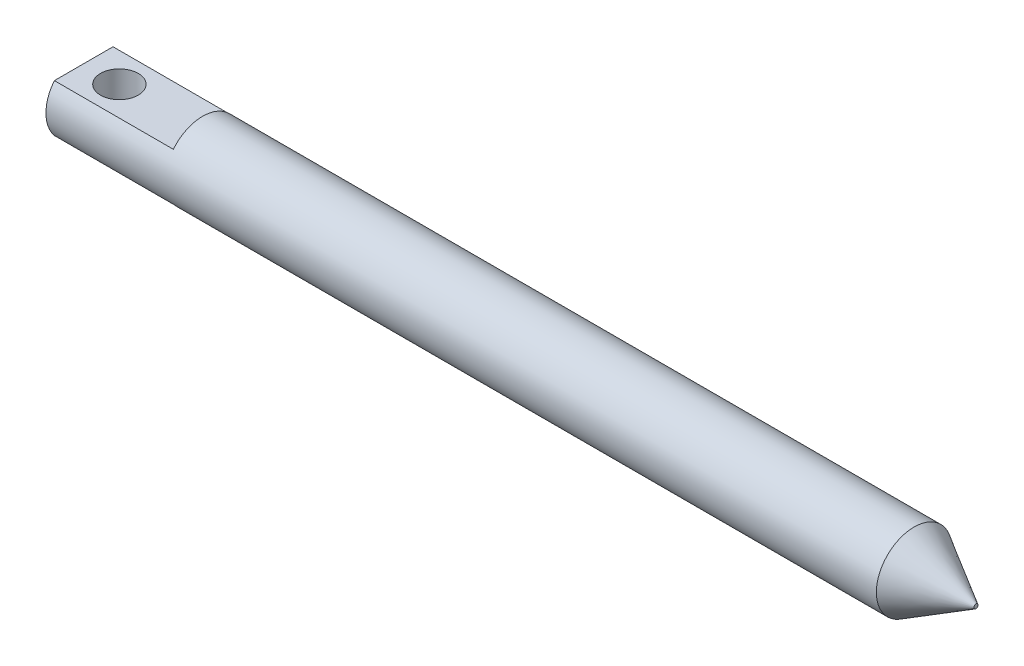
ISO-10303-21;
HEADER;
FILE_DESCRIPTION(('STEP AP214'),'2;1');
FILE_NAME('part.step','',(''),(''),'','','');
FILE_SCHEMA(('AUTOMOTIVE_DESIGN { 1 0 10303 214 1 1 1 1 }'));
ENDSEC;
DATA;
#1=APPLICATION_CONTEXT('core data for automotive mechanical design processes');
#2=APPLICATION_PROTOCOL_DEFINITION('international standard','automotive_design',2000,#1);
#3=PRODUCT_CONTEXT('',#1,'mechanical');
#4=PRODUCT('Part','Part','',(#3));
#5=PRODUCT_RELATED_PRODUCT_CATEGORY('part','',(#4));
#6=PRODUCT_DEFINITION_FORMATION('','',#4);
#7=PRODUCT_DEFINITION_CONTEXT('part definition',#1,'design');
#8=PRODUCT_DEFINITION('design','',#6,#7);
#9=PRODUCT_DEFINITION_SHAPE('','',#8);
#10=(LENGTH_UNIT() NAMED_UNIT(*) SI_UNIT(.MILLI.,.METRE.));
#11=(NAMED_UNIT(*) PLANE_ANGLE_UNIT() SI_UNIT($,.RADIAN.));
#12=(NAMED_UNIT(*) SI_UNIT($,.STERADIAN.) SOLID_ANGLE_UNIT());
#13=UNCERTAINTY_MEASURE_WITH_UNIT(LENGTH_MEASURE(1.E-05),#10,'distance_accuracy_value','');
#14=(GEOMETRIC_REPRESENTATION_CONTEXT(3) GLOBAL_UNCERTAINTY_ASSIGNED_CONTEXT((#13)) GLOBAL_UNIT_ASSIGNED_CONTEXT((#10,
#11,#12)) REPRESENTATION_CONTEXT('',''));
#15=CARTESIAN_POINT('',(0.,0.,0.));
#16=DIRECTION('',(0.,0.,1.));
#17=DIRECTION('',(1.,0.,0.));
#18=AXIS2_PLACEMENT_3D('',#15,#16,#17);
#19=CARTESIAN_POINT('',(29.,-44.302,0.));
#20=DIRECTION('',(0.,-1.,0.));
#21=DIRECTION('',(0.,0.,-1.));
#22=AXIS2_PLACEMENT_3D('',#19,#20,#21);
#23=PLANE('',#22);
#24=CARTESIAN_POINT('',(32.,-44.302,0.));
#25=DIRECTION('',(0.,-1.,0.));
#26=DIRECTION('',(0.,0.,-1.));
#27=AXIS2_PLACEMENT_3D('',#24,#25,#26);
#28=CIRCLE('',#27,1.5875);
#29=CARTESIAN_POINT('',(32.,-44.302,-1.5875));
#30=VERTEX_POINT('',#29);
#31=EDGE_CURVE('E117',#30,#30,#28,.T.);
#32=ORIENTED_EDGE('',*,*,#31,.T.);
#33=EDGE_LOOP('',(#32));
#34=FACE_BOUND('',#33,.T.);
#35=DIRECTION('',(0.,0.,-1.));
#36=VECTOR('',#35,1.);
#37=CARTESIAN_POINT('',(39.,-44.302,0.));
#38=LINE('',#37,#36);
#39=CARTESIAN_POINT('',(39.,-44.302,2.46589233341606));
#40=VERTEX_POINT('',#39);
#41=CARTESIAN_POINT('',(39.,-44.302,-2.46589233341604));
#42=VERTEX_POINT('',#41);
#43=EDGE_CURVE('E68',#40,#42,#38,.T.);
#44=ORIENTED_EDGE('',*,*,#43,.T.);
#45=DIRECTION('',(1.,0.,0.));
#46=VECTOR('',#45,1.);
#47=CARTESIAN_POINT('',(29.,-44.302,-2.46589233341604));
#48=LINE('',#47,#46);
#49=CARTESIAN_POINT('',(29.,-44.302,-2.46589233341604));
#50=VERTEX_POINT('',#49);
#51=EDGE_CURVE('E84',#50,#42,#48,.T.);
#52=ORIENTED_EDGE('',*,*,#51,.F.);
#53=DIRECTION('',(0.,0.,-1.));
#54=VECTOR('',#53,1.);
#55=CARTESIAN_POINT('',(29.,-44.302,0.));
#56=LINE('',#55,#54);
#57=CARTESIAN_POINT('',(29.,-44.302,2.46589233341604));
#58=VERTEX_POINT('',#57);
#59=EDGE_CURVE('E88',#58,#50,#56,.T.);
#60=ORIENTED_EDGE('',*,*,#59,.F.);
#61=DIRECTION('',(1.,0.,0.));
#62=VECTOR('',#61,1.);
#63=CARTESIAN_POINT('',(29.,-44.302,2.46589233341604));
#64=LINE('',#63,#62);
#65=EDGE_CURVE('E82',#58,#40,#64,.T.);
#66=ORIENTED_EDGE('',*,*,#65,.T.);
#67=EDGE_LOOP('',(#44,#52,#60,#66));
#68=FACE_BOUND('',#67,.T.);
#69=ADVANCED_FACE('F17',(#34,#68),#23,.F.);
#70=CARTESIAN_POINT('',(29.,-46.302,0.));
#71=DIRECTION('',(1.,0.,0.));
#72=DIRECTION('',(0.,0.,-1.));
#73=AXIS2_PLACEMENT_3D('',#70,#71,#72);
#74=CYLINDRICAL_SURFACE('',#73,3.175);
#75=CARTESIAN_POINT('',(98.8038475772934,-46.302,0.));
#76=DIRECTION('',(1.,0.,0.));
#77=DIRECTION('',(0.,0.,-1.));
#78=AXIS2_PLACEMENT_3D('',#75,#76,#77);
#79=CIRCLE('',#78,3.175);
#80=CARTESIAN_POINT('',(98.8038475772934,-46.302,-3.17500000000001));
#81=VERTEX_POINT('',#80);
#82=EDGE_CURVE('E11',#81,#81,#79,.F.);
#83=ORIENTED_EDGE('',*,*,#82,.T.);
#84=EDGE_LOOP('',(#83));
#85=FACE_BOUND('',#84,.T.);
#86=ORIENTED_EDGE('',*,*,#51,.T.);
#87=CARTESIAN_POINT('',(39.,-46.302,0.));
#88=DIRECTION('',(1.,0.,0.));
#89=DIRECTION('',(0.,0.,-1.));
#90=AXIS2_PLACEMENT_3D('',#87,#88,#89);
#91=CIRCLE('',#90,3.175);
#92=EDGE_CURVE('E71',#42,#40,#91,.T.);
#93=ORIENTED_EDGE('',*,*,#92,.T.);
#94=ORIENTED_EDGE('',*,*,#65,.F.);
#95=CARTESIAN_POINT('',(29.,-46.302,0.));
#96=DIRECTION('',(-1.,0.,0.));
#97=DIRECTION('',(0.,0.,1.));
#98=AXIS2_PLACEMENT_3D('',#95,#96,#97);
#99=CIRCLE('',#98,3.175);
#100=CARTESIAN_POINT('',(29.,-48.302,2.46589233341603));
#101=VERTEX_POINT('',#100);
#102=EDGE_CURVE('E106',#101,#58,#99,.T.);
#103=ORIENTED_EDGE('',*,*,#102,.F.);
#104=DIRECTION('',(1.,0.,0.));
#105=VECTOR('',#104,1.);
#106=CARTESIAN_POINT('',(29.,-48.302,2.46589233341603));
#107=LINE('',#106,#105);
#108=CARTESIAN_POINT('',(39.,-48.302,2.46589233341601));
#109=VERTEX_POINT('',#108);
#110=EDGE_CURVE('E39',#101,#109,#107,.T.);
#111=ORIENTED_EDGE('',*,*,#110,.T.);
#112=CARTESIAN_POINT('',(39.,-48.302,-2.46589233341602));
#113=VERTEX_POINT('',#112);
#114=EDGE_CURVE('E86',#109,#113,#91,.T.);
#115=ORIENTED_EDGE('',*,*,#114,.T.);
#116=DIRECTION('',(1.,0.,0.));
#117=VECTOR('',#116,1.);
#118=CARTESIAN_POINT('',(29.,-48.302,-2.46589233341604));
#119=LINE('',#118,#117);
#120=CARTESIAN_POINT('',(29.,-48.302,-2.46589233341604));
#121=VERTEX_POINT('',#120);
#122=EDGE_CURVE('E96',#121,#113,#119,.T.);
#123=ORIENTED_EDGE('',*,*,#122,.F.);
#124=CARTESIAN_POINT('',(29.,-46.302,0.));
#125=DIRECTION('',(-1.,0.,0.));
#126=DIRECTION('',(0.,0.,1.));
#127=AXIS2_PLACEMENT_3D('',#124,#125,#126);
#128=CIRCLE('',#127,3.175);
#129=EDGE_CURVE('E110',#50,#121,#128,.T.);
#130=ORIENTED_EDGE('',*,*,#129,.F.);
#131=EDGE_LOOP('',(#86,#93,#94,#103,#111,#115,#123,#130));
#132=FACE_BOUND('',#131,.T.);
#133=ADVANCED_FACE('F81',(#85,#132),#74,.T.);
#134=CARTESIAN_POINT('',(29.,-48.302,0.));
#135=DIRECTION('',(0.,-1.,0.));
#136=DIRECTION('',(0.,0.,-1.));
#137=AXIS2_PLACEMENT_3D('',#134,#135,#136);
#138=PLANE('',#137);
#139=CARTESIAN_POINT('',(32.,-48.302,0.));
#140=DIRECTION('',(0.,-1.,0.));
#141=DIRECTION('',(0.,0.,-1.));
#142=AXIS2_PLACEMENT_3D('',#139,#140,#141);
#143=CIRCLE('',#142,1.5875);
#144=CARTESIAN_POINT('',(32.,-48.302,-1.5875));
#145=VERTEX_POINT('',#144);
#146=EDGE_CURVE('E121',#145,#145,#143,.T.);
#147=ORIENTED_EDGE('',*,*,#146,.F.);
#148=EDGE_LOOP('',(#147));
#149=FACE_BOUND('',#148,.T.);
#150=DIRECTION('',(0.,0.,-1.));
#151=VECTOR('',#150,1.);
#152=CARTESIAN_POINT('',(39.,-48.302,0.));
#153=LINE('',#152,#151);
#154=EDGE_CURVE('E77',#109,#113,#153,.T.);
#155=ORIENTED_EDGE('',*,*,#154,.F.);
#156=ORIENTED_EDGE('',*,*,#110,.F.);
#157=DIRECTION('',(0.,0.,-1.));
#158=VECTOR('',#157,1.);
#159=CARTESIAN_POINT('',(29.,-48.302,0.));
#160=LINE('',#159,#158);
#161=EDGE_CURVE('E104',#101,#121,#160,.T.);
#162=ORIENTED_EDGE('',*,*,#161,.T.);
#163=ORIENTED_EDGE('',*,*,#122,.T.);
#164=EDGE_LOOP('',(#155,#156,#162,#163));
#165=FACE_BOUND('',#164,.T.);
#166=ADVANCED_FACE('F131',(#149,#165),#138,.T.);
#167=CARTESIAN_POINT('',(29.,-46.302,0.));
#168=DIRECTION('',(-1.,0.,0.));
#169=DIRECTION('',(0.,-1.,0.));
#170=AXIS2_PLACEMENT_3D('',#167,#168,#169);
#171=PLANE('',#170);
#172=ORIENTED_EDGE('',*,*,#102,.T.);
#173=ORIENTED_EDGE('',*,*,#59,.T.);
#174=ORIENTED_EDGE('',*,*,#129,.T.);
#175=ORIENTED_EDGE('',*,*,#161,.F.);
#176=EDGE_LOOP('',(#172,#173,#174,#175));
#177=FACE_BOUND('',#176,.T.);
#178=ADVANCED_FACE('F133',(#177),#171,.T.);
#179=CARTESIAN_POINT('',(39.,-46.302,0.));
#180=DIRECTION('',(1.,0.,0.));
#181=DIRECTION('',(0.,1.,0.));
#182=AXIS2_PLACEMENT_3D('',#179,#180,#181);
#183=PLANE('',#182);
#184=ORIENTED_EDGE('',*,*,#114,.F.);
#185=ORIENTED_EDGE('',*,*,#154,.T.);
#186=EDGE_LOOP('',(#184,#185));
#187=FACE_BOUND('',#186,.T.);
#188=ADVANCED_FACE('F138',(#187),#183,.F.);
#189=CARTESIAN_POINT('',(104.,-46.302,0.));
#190=DIRECTION('',(1.,0.,0.));
#191=DIRECTION('',(0.,1.,0.));
#192=AXIS2_PLACEMENT_3D('',#189,#190,#191);
#193=PLANE('',#192);
#194=CARTESIAN_POINT('',(104.,-46.302,0.));
#195=DIRECTION('',(1.,0.,0.));
#196=DIRECTION('',(0.,0.,-1.));
#197=AXIS2_PLACEMENT_3D('',#194,#195,#196);
#198=CIRCLE('',#197,0.174999999999997);
#199=CARTESIAN_POINT('',(104.,-46.302,-0.175000000000007));
#200=VERTEX_POINT('',#199);
#201=EDGE_CURVE('E27',#200,#200,#198,.T.);
#202=ORIENTED_EDGE('',*,*,#201,.T.);
#203=EDGE_LOOP('',(#202));
#204=FACE_BOUND('',#203,.T.);
#205=ADVANCED_FACE('F149',(#204),#193,.T.);
#206=ORIENTED_EDGE('',*,*,#43,.F.);
#207=ORIENTED_EDGE('',*,*,#92,.F.);
#208=EDGE_LOOP('',(#206,#207));
#209=FACE_BOUND('',#208,.T.);
#210=ADVANCED_FACE('F70',(#209),#183,.F.);
#211=CARTESIAN_POINT('',(32.,100.398092235495,0.));
#212=DIRECTION('',(0.,-1.,0.));
#213=DIRECTION('',(0.,0.,-1.));
#214=AXIS2_PLACEMENT_3D('',#211,#212,#213);
#215=CYLINDRICAL_SURFACE('',#214,1.5875);
#216=ORIENTED_EDGE('',*,*,#146,.T.);
#217=EDGE_LOOP('',(#216));
#218=FACE_BOUND('',#217,.T.);
#219=ORIENTED_EDGE('',*,*,#31,.F.);
#220=EDGE_LOOP('',(#219));
#221=FACE_BOUND('',#220,.T.);
#222=ADVANCED_FACE('F128',(#218,#221),#215,.F.);
#223=CARTESIAN_POINT('',(104.,-46.302,0.));
#224=DIRECTION('',(-1.,0.,0.));
#225=DIRECTION('',(0.,0.,1.));
#226=AXIS2_PLACEMENT_3D('',#223,#224,#225);
#227=CONICAL_SURFACE('',#226,0.174999999999997,0.523598775598299);
#228=ORIENTED_EDGE('',*,*,#82,.F.);
#229=EDGE_LOOP('',(#228));
#230=FACE_BOUND('',#229,.T.);
#231=ORIENTED_EDGE('',*,*,#201,.F.);
#232=EDGE_LOOP('',(#231));
#233=FACE_BOUND('',#232,.T.);
#234=ADVANCED_FACE('F19',(#230,#233),#227,.T.);
#235=CLOSED_SHELL('',(#69,#133,#166,#178,#188,#205,#210,#222,#234));
#236=MANIFOLD_SOLID_BREP('B1',#235);
#237=ADVANCED_BREP_SHAPE_REPRESENTATION('',(#18,#236),#14);
#238=SHAPE_DEFINITION_REPRESENTATION(#9,#237);
ENDSEC;
END-ISO-10303-21;
